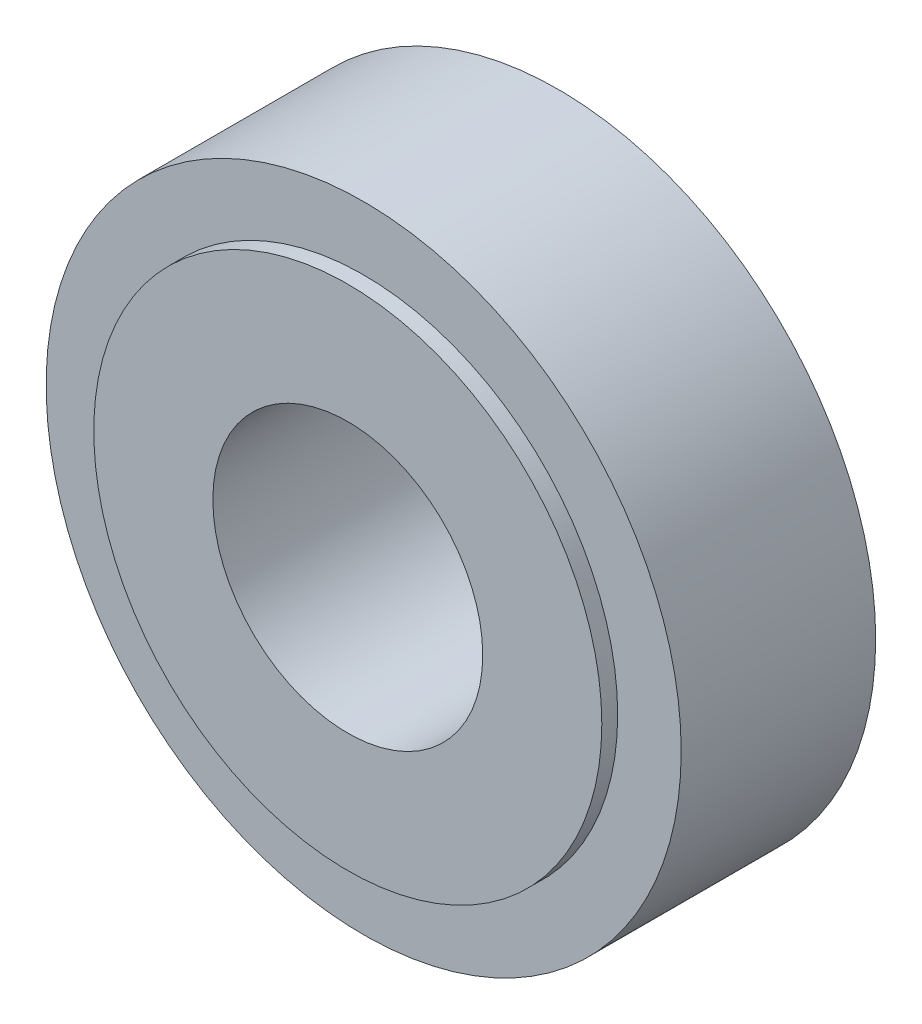
ISO-10303-21;
HEADER;
FILE_DESCRIPTION(('STEP AP214'),'2;1');
FILE_NAME('part.step','',(''),(''),'','','');
FILE_SCHEMA(('AUTOMOTIVE_DESIGN { 1 0 10303 214 1 1 1 1 }'));
ENDSEC;
DATA;
#1=APPLICATION_CONTEXT('core data for automotive mechanical design processes');
#2=APPLICATION_PROTOCOL_DEFINITION('international standard','automotive_design',2000,#1);
#3=PRODUCT_CONTEXT('',#1,'mechanical');
#4=PRODUCT('Part','Part','',(#3));
#5=PRODUCT_RELATED_PRODUCT_CATEGORY('part','',(#4));
#6=PRODUCT_DEFINITION_FORMATION('','',#4);
#7=PRODUCT_DEFINITION_CONTEXT('part definition',#1,'design');
#8=PRODUCT_DEFINITION('design','',#6,#7);
#9=PRODUCT_DEFINITION_SHAPE('','',#8);
#10=(LENGTH_UNIT() NAMED_UNIT(*) SI_UNIT(.MILLI.,.METRE.));
#11=(NAMED_UNIT(*) PLANE_ANGLE_UNIT() SI_UNIT($,.RADIAN.));
#12=(NAMED_UNIT(*) SI_UNIT($,.STERADIAN.) SOLID_ANGLE_UNIT());
#13=UNCERTAINTY_MEASURE_WITH_UNIT(LENGTH_MEASURE(1.E-05),#10,'distance_accuracy_value','');
#14=(GEOMETRIC_REPRESENTATION_CONTEXT(3) GLOBAL_UNCERTAINTY_ASSIGNED_CONTEXT((#13)) GLOBAL_UNIT_ASSIGNED_CONTEXT((#10,
#11,#12)) REPRESENTATION_CONTEXT('',''));
#15=CARTESIAN_POINT('',(0.,0.,0.));
#16=DIRECTION('',(0.,0.,1.));
#17=DIRECTION('',(1.,0.,0.));
#18=AXIS2_PLACEMENT_3D('',#15,#16,#17);
#19=CARTESIAN_POINT('',(0.,0.,13.25));
#20=DIRECTION('',(0.,0.,1.));
#21=DIRECTION('',(1.,0.,0.));
#22=AXIS2_PLACEMENT_3D('',#19,#20,#21);
#23=PLANE('',#22);
#24=CARTESIAN_POINT('',(0.,0.,13.25));
#25=DIRECTION('',(0.,0.,1.));
#26=DIRECTION('',(1.,0.,0.));
#27=AXIS2_PLACEMENT_3D('',#24,#25,#26);
#28=CIRCLE('',#27,8.5);
#29=CARTESIAN_POINT('',(8.5,0.,13.25));
#30=VERTEX_POINT('',#29);
#31=EDGE_CURVE('E47',#30,#30,#28,.T.);
#32=ORIENTED_EDGE('',*,*,#31,.F.);
#33=EDGE_LOOP('',(#32));
#34=FACE_BOUND('',#33,.T.);
#35=CARTESIAN_POINT('',(0.,0.,13.25));
#36=DIRECTION('',(0.,0.,1.));
#37=DIRECTION('',(1.,0.,0.));
#38=AXIS2_PLACEMENT_3D('',#35,#36,#37);
#39=CIRCLE('',#38,16.);
#40=CARTESIAN_POINT('',(16.,0.,13.25));
#41=VERTEX_POINT('',#40);
#42=EDGE_CURVE('E70',#41,#41,#39,.T.);
#43=ORIENTED_EDGE('',*,*,#42,.T.);
#44=EDGE_LOOP('',(#43));
#45=FACE_BOUND('',#44,.T.);
#46=ADVANCED_FACE('F38',(#34,#45),#23,.T.);
#47=CARTESIAN_POINT('',(0.,0.,13.25));
#48=DIRECTION('',(0.,0.,-1.));
#49=DIRECTION('',(-1.,0.,0.));
#50=AXIS2_PLACEMENT_3D('',#47,#48,#49);
#51=CYLINDRICAL_SURFACE('',#50,20.);
#52=CARTESIAN_POINT('',(0.,0.,0.));
#53=DIRECTION('',(0.,0.,1.));
#54=DIRECTION('',(1.,0.,0.));
#55=AXIS2_PLACEMENT_3D('',#52,#53,#54);
#56=CIRCLE('',#55,20.);
#57=CARTESIAN_POINT('',(20.,0.,0.));
#58=VERTEX_POINT('',#57);
#59=EDGE_CURVE('E11',#58,#58,#56,.T.);
#60=ORIENTED_EDGE('',*,*,#59,.T.);
#61=EDGE_LOOP('',(#60));
#62=FACE_BOUND('',#61,.T.);
#63=CARTESIAN_POINT('',(0.,0.,12.25));
#64=DIRECTION('',(0.,0.,1.));
#65=DIRECTION('',(1.,0.,0.));
#66=AXIS2_PLACEMENT_3D('',#63,#64,#65);
#67=CIRCLE('',#66,20.);
#68=CARTESIAN_POINT('',(20.,0.,12.25));
#69=VERTEX_POINT('',#68);
#70=EDGE_CURVE('E42',#69,#69,#67,.T.);
#71=ORIENTED_EDGE('',*,*,#70,.F.);
#72=EDGE_LOOP('',(#71));
#73=FACE_BOUND('',#72,.T.);
#74=ADVANCED_FACE('F40',(#62,#73),#51,.T.);
#75=CARTESIAN_POINT('',(0.,0.,13.25));
#76=DIRECTION('',(0.,0.,-1.));
#77=DIRECTION('',(-1.,0.,0.));
#78=AXIS2_PLACEMENT_3D('',#75,#76,#77);
#79=CYLINDRICAL_SURFACE('',#78,8.5);
#80=ORIENTED_EDGE('',*,*,#31,.T.);
#81=EDGE_LOOP('',(#80));
#82=FACE_BOUND('',#81,.T.);
#83=CARTESIAN_POINT('',(0.,0.,0.999999999999999));
#84=DIRECTION('',(0.,0.,-1.));
#85=DIRECTION('',(-1.,0.,0.));
#86=AXIS2_PLACEMENT_3D('',#83,#84,#85);
#87=CIRCLE('',#86,8.5);
#88=CARTESIAN_POINT('',(-8.5,0.,0.999999999999999));
#89=VERTEX_POINT('',#88);
#90=EDGE_CURVE('E53',#89,#89,#87,.T.);
#91=ORIENTED_EDGE('',*,*,#90,.T.);
#92=EDGE_LOOP('',(#91));
#93=FACE_BOUND('',#92,.T.);
#94=ADVANCED_FACE('F86',(#82,#93),#79,.F.);
#95=CARTESIAN_POINT('',(0.,0.,0.));
#96=DIRECTION('',(0.,0.,1.));
#97=DIRECTION('',(1.,0.,0.));
#98=AXIS2_PLACEMENT_3D('',#95,#96,#97);
#99=PLANE('',#98);
#100=CARTESIAN_POINT('',(0.,0.,0.));
#101=DIRECTION('',(0.,0.,-1.));
#102=DIRECTION('',(-1.,0.,0.));
#103=AXIS2_PLACEMENT_3D('',#100,#101,#102);
#104=CIRCLE('',#103,17.);
#105=CARTESIAN_POINT('',(-17.,0.,0.));
#106=VERTEX_POINT('',#105);
#107=EDGE_CURVE('E63',#106,#106,#104,.T.);
#108=ORIENTED_EDGE('',*,*,#107,.F.);
#109=EDGE_LOOP('',(#108));
#110=FACE_BOUND('',#109,.T.);
#111=ORIENTED_EDGE('',*,*,#59,.F.);
#112=EDGE_LOOP('',(#111));
#113=FACE_BOUND('',#112,.T.);
#114=ADVANCED_FACE('F91',(#110,#113),#99,.F.);
#115=CARTESIAN_POINT('',(0.,0.,1.));
#116=DIRECTION('',(0.,0.,-1.));
#117=DIRECTION('',(-1.,0.,0.));
#118=AXIS2_PLACEMENT_3D('',#115,#116,#117);
#119=CYLINDRICAL_SURFACE('',#118,17.);
#120=CARTESIAN_POINT('',(0.,0.,1.));
#121=DIRECTION('',(0.,0.,-1.));
#122=DIRECTION('',(-1.,0.,0.));
#123=AXIS2_PLACEMENT_3D('',#120,#121,#122);
#124=CIRCLE('',#123,17.);
#125=CARTESIAN_POINT('',(-17.,0.,1.));
#126=VERTEX_POINT('',#125);
#127=EDGE_CURVE('E58',#126,#126,#124,.T.);
#128=ORIENTED_EDGE('',*,*,#127,.F.);
#129=EDGE_LOOP('',(#128));
#130=FACE_BOUND('',#129,.T.);
#131=ORIENTED_EDGE('',*,*,#107,.T.);
#132=EDGE_LOOP('',(#131));
#133=FACE_BOUND('',#132,.T.);
#134=ADVANCED_FACE('F102',(#130,#133),#119,.F.);
#135=CARTESIAN_POINT('',(0.,0.,1.));
#136=DIRECTION('',(0.,0.,-1.));
#137=DIRECTION('',(-1.,0.,0.));
#138=AXIS2_PLACEMENT_3D('',#135,#136,#137);
#139=PLANE('',#138);
#140=ORIENTED_EDGE('',*,*,#90,.F.);
#141=EDGE_LOOP('',(#140));
#142=FACE_BOUND('',#141,.T.);
#143=ORIENTED_EDGE('',*,*,#127,.T.);
#144=EDGE_LOOP('',(#143));
#145=FACE_BOUND('',#144,.T.);
#146=ADVANCED_FACE('F107',(#142,#145),#139,.T.);
#147=CARTESIAN_POINT('',(0.,0.,12.25));
#148=DIRECTION('',(0.,0.,1.));
#149=DIRECTION('',(1.,0.,0.));
#150=AXIS2_PLACEMENT_3D('',#147,#148,#149);
#151=PLANE('',#150);
#152=CARTESIAN_POINT('',(0.,0.,12.25));
#153=DIRECTION('',(0.,0.,1.));
#154=DIRECTION('',(1.,0.,0.));
#155=AXIS2_PLACEMENT_3D('',#152,#153,#154);
#156=CIRCLE('',#155,16.);
#157=CARTESIAN_POINT('',(16.,0.,12.25));
#158=VERTEX_POINT('',#157);
#159=EDGE_CURVE('E74',#158,#158,#156,.T.);
#160=ORIENTED_EDGE('',*,*,#159,.F.);
#161=EDGE_LOOP('',(#160));
#162=FACE_BOUND('',#161,.T.);
#163=ORIENTED_EDGE('',*,*,#70,.T.);
#164=EDGE_LOOP('',(#163));
#165=FACE_BOUND('',#164,.T.);
#166=ADVANCED_FACE('F83',(#162,#165),#151,.T.);
#167=CARTESIAN_POINT('',(0.,0.,12.25));
#168=DIRECTION('',(0.,0.,1.));
#169=DIRECTION('',(1.,0.,0.));
#170=AXIS2_PLACEMENT_3D('',#167,#168,#169);
#171=CYLINDRICAL_SURFACE('',#170,16.);
#172=ORIENTED_EDGE('',*,*,#159,.T.);
#173=EDGE_LOOP('',(#172));
#174=FACE_BOUND('',#173,.T.);
#175=ORIENTED_EDGE('',*,*,#42,.F.);
#176=EDGE_LOOP('',(#175));
#177=FACE_BOUND('',#176,.T.);
#178=ADVANCED_FACE('F120',(#174,#177),#171,.T.);
#179=CLOSED_SHELL('',(#46,#74,#94,#114,#134,#146,#166,#178));
#180=MANIFOLD_SOLID_BREP('B2',#179);
#181=ADVANCED_BREP_SHAPE_REPRESENTATION('',(#18,#180),#14);
#182=SHAPE_DEFINITION_REPRESENTATION(#9,#181);
ENDSEC;
END-ISO-10303-21;
